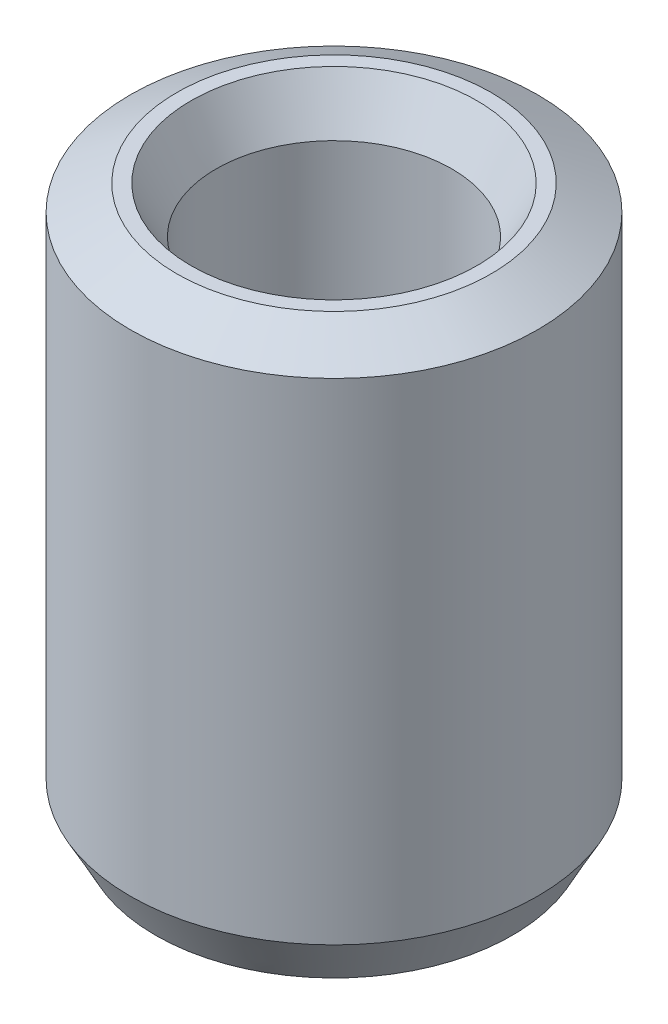
ISO-10303-21;
HEADER;
FILE_DESCRIPTION(('STEP AP214'),'2;1');
FILE_NAME('part.step','',(''),(''),'','','');
FILE_SCHEMA(('AUTOMOTIVE_DESIGN { 1 0 10303 214 1 1 1 1 }'));
ENDSEC;
DATA;
#1=APPLICATION_CONTEXT('core data for automotive mechanical design processes');
#2=APPLICATION_PROTOCOL_DEFINITION('international standard','automotive_design',2000,#1);
#3=PRODUCT_CONTEXT('',#1,'mechanical');
#4=PRODUCT('Part','Part','',(#3));
#5=PRODUCT_RELATED_PRODUCT_CATEGORY('part','',(#4));
#6=PRODUCT_DEFINITION_FORMATION('','',#4);
#7=PRODUCT_DEFINITION_CONTEXT('part definition',#1,'design');
#8=PRODUCT_DEFINITION('design','',#6,#7);
#9=PRODUCT_DEFINITION_SHAPE('','',#8);
#10=(LENGTH_UNIT() NAMED_UNIT(*) SI_UNIT(.MILLI.,.METRE.));
#11=(NAMED_UNIT(*) PLANE_ANGLE_UNIT() SI_UNIT($,.RADIAN.));
#12=(NAMED_UNIT(*) SI_UNIT($,.STERADIAN.) SOLID_ANGLE_UNIT());
#13=UNCERTAINTY_MEASURE_WITH_UNIT(LENGTH_MEASURE(1.E-05),#10,'distance_accuracy_value','');
#14=(GEOMETRIC_REPRESENTATION_CONTEXT(3) GLOBAL_UNCERTAINTY_ASSIGNED_CONTEXT((#13)) GLOBAL_UNIT_ASSIGNED_CONTEXT((#10,
#11,#12)) REPRESENTATION_CONTEXT('',''));
#15=CARTESIAN_POINT('',(0.,0.,0.));
#16=DIRECTION('',(0.,0.,1.));
#17=DIRECTION('',(1.,0.,0.));
#18=AXIS2_PLACEMENT_3D('',#15,#16,#17);
#19=CARTESIAN_POINT('',(0.,82.8377908763689,0.));
#20=DIRECTION('',(0.,-1.,0.));
#21=DIRECTION('',(0.,0.,-1.));
#22=AXIS2_PLACEMENT_3D('',#19,#20,#21);
#23=CYLINDRICAL_SURFACE('',#22,30.);
#24=CARTESIAN_POINT('',(0.,6.84503875555852,0.));
#25=DIRECTION('',(0.,1.,0.));
#26=DIRECTION('',(0.,0.,1.));
#27=AXIS2_PLACEMENT_3D('',#24,#25,#26);
#28=CIRCLE('',#27,30.);
#29=CARTESIAN_POINT('',(0.,6.84503875555852,30.));
#30=VERTEX_POINT('',#29);
#31=EDGE_CURVE('E10',#30,#30,#28,.T.);
#32=ORIENTED_EDGE('',*,*,#31,.T.);
#33=EDGE_LOOP('',(#32));
#34=FACE_BOUND('',#33,.T.);
#35=CARTESIAN_POINT('',(0.,79.1286091399344,0.));
#36=DIRECTION('',(0.,1.,0.));
#37=DIRECTION('',(0.,0.,1.));
#38=AXIS2_PLACEMENT_3D('',#35,#36,#37);
#39=CIRCLE('',#38,30.);
#40=CARTESIAN_POINT('',(0.,79.1286091399344,30.));
#41=VERTEX_POINT('',#40);
#42=EDGE_CURVE('E50',#41,#41,#39,.F.);
#43=ORIENTED_EDGE('',*,*,#42,.T.);
#44=EDGE_LOOP('',(#43));
#45=FACE_BOUND('',#44,.T.);
#46=ADVANCED_FACE('F39',(#34,#45),#23,.T.);
#47=CARTESIAN_POINT('',(0.,82.8377908763689,0.));
#48=DIRECTION('',(0.,1.,0.));
#49=DIRECTION('',(0.,0.,1.));
#50=AXIS2_PLACEMENT_3D('',#47,#48,#49);
#51=PLANE('',#50);
#52=CARTESIAN_POINT('',(0.,82.8377908763689,0.));
#53=DIRECTION('',(0.,1.,0.));
#54=DIRECTION('',(0.,0.,1.));
#55=AXIS2_PLACEMENT_3D('',#52,#53,#54);
#56=CIRCLE('',#55,21.0687852079461);
#57=CARTESIAN_POINT('',(0.,82.8377908763689,21.0687852079461));
#58=VERTEX_POINT('',#57);
#59=EDGE_CURVE('E58',#58,#58,#56,.F.);
#60=ORIENTED_EDGE('',*,*,#59,.T.);
#61=EDGE_LOOP('',(#60));
#62=FACE_BOUND('',#61,.T.);
#63=CARTESIAN_POINT('',(0.,82.8377908763689,0.));
#64=DIRECTION('',(0.,1.,0.));
#65=DIRECTION('',(0.,0.,1.));
#66=AXIS2_PLACEMENT_3D('',#63,#64,#65);
#67=CIRCLE('',#66,23.1549612444415);
#68=CARTESIAN_POINT('',(0.,82.8377908763689,23.1549612444415));
#69=VERTEX_POINT('',#68);
#70=EDGE_CURVE('E61',#69,#69,#67,.T.);
#71=ORIENTED_EDGE('',*,*,#70,.T.);
#72=EDGE_LOOP('',(#71));
#73=FACE_BOUND('',#72,.T.);
#74=ADVANCED_FACE('F88',(#62,#73),#51,.T.);
#75=CARTESIAN_POINT('',(0.,0.,0.));
#76=DIRECTION('',(0.,1.,0.));
#77=DIRECTION('',(0.,0.,1.));
#78=AXIS2_PLACEMENT_3D('',#75,#76,#77);
#79=PLANE('',#78);
#80=CARTESIAN_POINT('',(0.,0.,0.));
#81=DIRECTION('',(0.,1.,0.));
#82=DIRECTION('',(0.,0.,1.));
#83=AXIS2_PLACEMENT_3D('',#80,#81,#82);
#84=CIRCLE('',#83,24.20464222707);
#85=CARTESIAN_POINT('',(0.,0.,-24.20464222707));
#86=VERTEX_POINT('',#85);
#87=EDGE_CURVE('E51',#86,#86,#84,.T.);
#88=ORIENTED_EDGE('',*,*,#87,.T.);
#89=EDGE_LOOP('',(#88));
#90=FACE_BOUND('',#89,.T.);
#91=CARTESIAN_POINT('',(0.,0.,0.));
#92=DIRECTION('',(0.,1.,0.));
#93=DIRECTION('',(0.,0.,1.));
#94=AXIS2_PLACEMENT_3D('',#91,#92,#93);
#95=CIRCLE('',#94,26.2908182635655);
#96=CARTESIAN_POINT('',(0.,0.,26.2908182635655));
#97=VERTEX_POINT('',#96);
#98=EDGE_CURVE('E54',#97,#97,#95,.F.);
#99=ORIENTED_EDGE('',*,*,#98,.T.);
#100=EDGE_LOOP('',(#99));
#101=FACE_BOUND('',#100,.T.);
#102=ADVANCED_FACE('F83',(#90,#101),#79,.F.);
#103=CARTESIAN_POINT('',(0.,82.8377908763689,0.));
#104=DIRECTION('',(0.,-1.,0.));
#105=DIRECTION('',(0.,0.,-1.));
#106=AXIS2_PLACEMENT_3D('',#103,#104,#105);
#107=CYLINDRICAL_SURFACE('',#106,17.3596034715116);
#108=CARTESIAN_POINT('',(0.,75.9927521208104,0.));
#109=DIRECTION('',(0.,1.,0.));
#110=DIRECTION('',(0.,0.,1.));
#111=AXIS2_PLACEMENT_3D('',#108,#109,#110);
#112=CIRCLE('',#111,17.3596034715116);
#113=CARTESIAN_POINT('',(0.,75.9927521208104,17.3596034715116));
#114=VERTEX_POINT('',#113);
#115=EDGE_CURVE('E67',#114,#114,#112,.T.);
#116=ORIENTED_EDGE('',*,*,#115,.T.);
#117=EDGE_LOOP('',(#116));
#118=FACE_BOUND('',#117,.T.);
#119=CARTESIAN_POINT('',(0.,3.70918173643449,0.));
#120=DIRECTION('',(0.,1.,0.));
#121=DIRECTION('',(0.,0.,1.));
#122=AXIS2_PLACEMENT_3D('',#119,#120,#121);
#123=CIRCLE('',#122,17.3596034715116);
#124=CARTESIAN_POINT('',(0.,3.70918173643449,-17.3596034715116));
#125=VERTEX_POINT('',#124);
#126=EDGE_CURVE('E69',#125,#125,#123,.F.);
#127=ORIENTED_EDGE('',*,*,#126,.T.);
#128=EDGE_LOOP('',(#127));
#129=FACE_BOUND('',#128,.T.);
#130=ADVANCED_FACE('F71',(#118,#129),#107,.F.);
#131=CARTESIAN_POINT('',(0.,75.9927521208104,0.));
#132=DIRECTION('',(0.,1.,0.));
#133=DIRECTION('',(0.,0.,1.));
#134=AXIS2_PLACEMENT_3D('',#131,#132,#133);
#135=CONICAL_SURFACE('',#134,17.3596034715116,0.496586790128837);
#136=ORIENTED_EDGE('',*,*,#59,.F.);
#137=EDGE_LOOP('',(#136));
#138=FACE_BOUND('',#137,.T.);
#139=ORIENTED_EDGE('',*,*,#115,.F.);
#140=EDGE_LOOP('',(#139));
#141=FACE_BOUND('',#140,.T.);
#142=ADVANCED_FACE('F77',(#138,#141),#135,.F.);
#143=CARTESIAN_POINT('',(0.,0.,0.));
#144=DIRECTION('',(0.,-1.,0.));
#145=DIRECTION('',(0.,0.,-1.));
#146=AXIS2_PLACEMENT_3D('',#143,#144,#145);
#147=CONICAL_SURFACE('',#146,24.20464222707,1.07420953666606);
#148=CARTESIAN_POINT('',(0.,3.70918173643449,-17.3596034715116));
#149=CARTESIAN_POINT('',(0.,3.67054442667996,-17.4309059585486));
#150=CARTESIAN_POINT('',(0.,3.63190711692544,-17.5022084455857));
#151=CARTESIAN_POINT('',(0.,3.55463249741638,-17.6448134196598));
#152=CARTESIAN_POINT('',(0.,3.51599518766186,-17.7161159066969));
#153=CARTESIAN_POINT('',(0.,3.43872056815281,-17.858720880771));
#154=CARTESIAN_POINT('',(0.,3.40008325839828,-17.9300233678081));
#155=CARTESIAN_POINT('',(0.,3.32280863888923,-18.0726283418822));
#156=CARTESIAN_POINT('',(0.,3.2841713291347,-18.1439308289193));
#157=CARTESIAN_POINT('',(0.,3.20689670962565,-18.2865358029934));
#158=CARTESIAN_POINT('',(0.,3.16825939987113,-18.3578382900305));
#159=CARTESIAN_POINT('',(0.,3.09098478036207,-18.5004432641046));
#160=CARTESIAN_POINT('',(0.,3.05234747060755,-18.5717457511417));
#161=CARTESIAN_POINT('',(0.,2.9750728510985,-18.7143507252158));
#162=CARTESIAN_POINT('',(0.,2.93643554134397,-18.7856532122529));
#163=CARTESIAN_POINT('',(0.,2.85916092183492,-18.928258186327));
#164=CARTESIAN_POINT('',(0.,2.82052361208039,-18.9995606733641));
#165=CARTESIAN_POINT('',(0.,2.74324899257134,-19.1421656474382));
#166=CARTESIAN_POINT('',(0.,2.70461168281681,-19.2134681344753));
#167=CARTESIAN_POINT('',(0.,2.62733706330776,-19.3560731085494));
#168=CARTESIAN_POINT('',(0.,2.58869975355324,-19.4273755955865));
#169=CARTESIAN_POINT('',(0.,2.51142513404418,-19.5699805696606));
#170=CARTESIAN_POINT('',(0.,2.47278782428966,-19.6412830566977));
#171=CARTESIAN_POINT('',(0.,2.39551320478061,-19.7838880307718));
#172=CARTESIAN_POINT('',(0.,2.35687589502608,-19.8551905178089));
#173=CARTESIAN_POINT('',(0.,2.27960127551703,-19.997795491883));
#174=CARTESIAN_POINT('',(0.,2.2409639657625,-20.0690979789201));
#175=CARTESIAN_POINT('',(0.,2.16368934625345,-20.2117029529942));
#176=CARTESIAN_POINT('',(0.,2.12505203649893,-20.2830054400313));
#177=CARTESIAN_POINT('',(0.,2.04777741698987,-20.4256104141054));
#178=CARTESIAN_POINT('',(0.,2.00914010723535,-20.4969129011425));
#179=CARTESIAN_POINT('',(0.,1.9318654877263,-20.6395178752166));
#180=CARTESIAN_POINT('',(0.,1.89322817797177,-20.7108203622537));
#181=CARTESIAN_POINT('',(0.,1.81595355846272,-20.8534253363279));
#182=CARTESIAN_POINT('',(0.,1.77731624870819,-20.9247278233649));
#183=CARTESIAN_POINT('',(0.,1.70004162919914,-21.0673327974391));
#184=CARTESIAN_POINT('',(0.,1.66140431944461,-21.1386352844761));
#185=CARTESIAN_POINT('',(0.,1.58412969993556,-21.2812402585503));
#186=CARTESIAN_POINT('',(0.,1.54549239018104,-21.3525427455873));
#187=CARTESIAN_POINT('',(0.,1.46821777067198,-21.4951477196615));
#188=CARTESIAN_POINT('',(0.,1.42958046091746,-21.5664502066985));
#189=CARTESIAN_POINT('',(0.,1.35230584140841,-21.7090551807727));
#190=CARTESIAN_POINT('',(0.,1.31366853165388,-21.7803576678097));
#191=CARTESIAN_POINT('',(0.,1.23639391214483,-21.9229626418839));
#192=CARTESIAN_POINT('',(0.,1.1977566023903,-21.9942651289209));
#193=CARTESIAN_POINT('',(0.,1.12048198288125,-22.1368701029951));
#194=CARTESIAN_POINT('',(0.,1.08184467312673,-22.2081725900321));
#195=CARTESIAN_POINT('',(0.,1.00457005361767,-22.3507775641063));
#196=CARTESIAN_POINT('',(0.,0.965932743863148,-22.4220800511433));
#197=CARTESIAN_POINT('',(0.,0.888658124354096,-22.5646850252175));
#198=CARTESIAN_POINT('',(0.,0.85002081459957,-22.6359875122545));
#199=CARTESIAN_POINT('',(0.,0.772746195090519,-22.7785924863287));
#200=CARTESIAN_POINT('',(0.,0.734108885335993,-22.8498949733657));
#201=CARTESIAN_POINT('',(0.,0.65683426582694,-22.9924999474399));
#202=CARTESIAN_POINT('',(0.,0.618196956072414,-23.0638024344769));
#203=CARTESIAN_POINT('',(0.,0.540922336563363,-23.2064074085511));
#204=CARTESIAN_POINT('',(0.,0.502285026808837,-23.2777098955881));
#205=CARTESIAN_POINT('',(0.,0.425010407299785,-23.4203148696623));
#206=CARTESIAN_POINT('',(0.,0.386373097545259,-23.4916173566993));
#207=CARTESIAN_POINT('',(0.,0.309098478036207,-23.6342223307735));
#208=CARTESIAN_POINT('',(0.,0.270461168281681,-23.7055248178105));
#209=CARTESIAN_POINT('',(0.,0.193186548772629,-23.8481297918847));
#210=CARTESIAN_POINT('',(0.,0.154549239018104,-23.9194322789217));
#211=CARTESIAN_POINT('',(0.,0.0772746195090523,-24.0620372529959));
#212=CARTESIAN_POINT('',(0.,0.0386373097545267,-24.1333397400329));
#213=CARTESIAN_POINT('',(0.,0.,-24.20464222707));
#214=B_SPLINE_CURVE_WITH_KNOTS('',3,(#148,#149,#150,#151,#152,#153,#154,#155,#156,#157,#158,
#159,#160,#161,#162,#163,#164,#165,#166,#167,#168,#169,#170,#171,#172,#173,#174,#175,#176,#177,
#178,#179,#180,#181,#182,#183,#184,#185,#186,#187,#188,#189,#190,#191,#192,#193,#194,#195,#196,
#197,#198,#199,#200,#201,#202,#203,#204,#205,#206,#207,#208,#209,#210,#211,#212,#213),
.UNSPECIFIED.,.F.,.F.,(4,2,2,2,2,2,2,2,2,2,2,2,2,2,2,2,2,2,2,2,2,2,2,2,2,2,2,2,2,2,2,2,4),(0.,
0.243294014033729,0.486588028067462,0.729882042101191,0.97317605613492,1.21647007016865,
1.45976408420238,1.70305809823611,1.94635211226984,2.18964612630357,2.4329401403373,
2.67623415437103,2.91952816840476,3.16282218243849,3.40611619647223,3.64941021050595,
3.89270422453968,4.13599823857342,4.37929225260715,4.62258626664087,4.86588028067461,
5.10917429470834,5.35246830874206,5.5957623227758,5.83905633680953,6.08235035084326,
6.32564436487699,6.56893837891072,6.81223239294445,7.05552640697818,7.29882042101191,
7.54211443504564,7.78540844907937),.UNSPECIFIED.);
#215=EDGE_CURVE('BSEAM73',#125,#86,#214,.T.);
#216=ORIENTED_EDGE('',*,*,#126,.F.);
#217=ORIENTED_EDGE('',*,*,#87,.F.);
#218=ORIENTED_EDGE('',*,*,#215,.T.);
#219=ORIENTED_EDGE('',*,*,#215,.F.);
#220=EDGE_LOOP('',(#216,#218,#217,#219));
#221=FACE_BOUND('',#220,.T.);
#222=ADVANCED_FACE('F73',(#221),#147,.F.);
#223=CARTESIAN_POINT('',(0.,6.84503875555852,0.));
#224=DIRECTION('',(0.,1.,0.));
#225=DIRECTION('',(0.,0.,1.));
#226=AXIS2_PLACEMENT_3D('',#223,#224,#225);
#227=CONICAL_SURFACE('',#226,30.,0.496586790128837);
#228=ORIENTED_EDGE('',*,*,#98,.F.);
#229=EDGE_LOOP('',(#228));
#230=FACE_BOUND('',#229,.T.);
#231=ORIENTED_EDGE('',*,*,#31,.F.);
#232=EDGE_LOOP('',(#231));
#233=FACE_BOUND('',#232,.T.);
#234=ADVANCED_FACE('F76',(#230,#233),#227,.T.);
#235=CARTESIAN_POINT('',(0.,82.8377908763689,0.));
#236=DIRECTION('',(0.,-1.,0.));
#237=DIRECTION('',(0.,0.,-1.));
#238=AXIS2_PLACEMENT_3D('',#235,#236,#237);
#239=CONICAL_SURFACE('',#238,23.1549612444415,1.07420953666606);
#240=ORIENTED_EDGE('',*,*,#42,.F.);
#241=EDGE_LOOP('',(#240));
#242=FACE_BOUND('',#241,.T.);
#243=ORIENTED_EDGE('',*,*,#70,.F.);
#244=EDGE_LOOP('',(#243));
#245=FACE_BOUND('',#244,.T.);
#246=ADVANCED_FACE('F45',(#242,#245),#239,.T.);
#247=CLOSED_SHELL('',(#46,#74,#102,#130,#142,#222,#234,#246));
#248=MANIFOLD_SOLID_BREP('B2',#247);
#249=ADVANCED_BREP_SHAPE_REPRESENTATION('',(#18,#248),#14);
#250=SHAPE_DEFINITION_REPRESENTATION(#9,#249);
ENDSEC;
END-ISO-10303-21;
